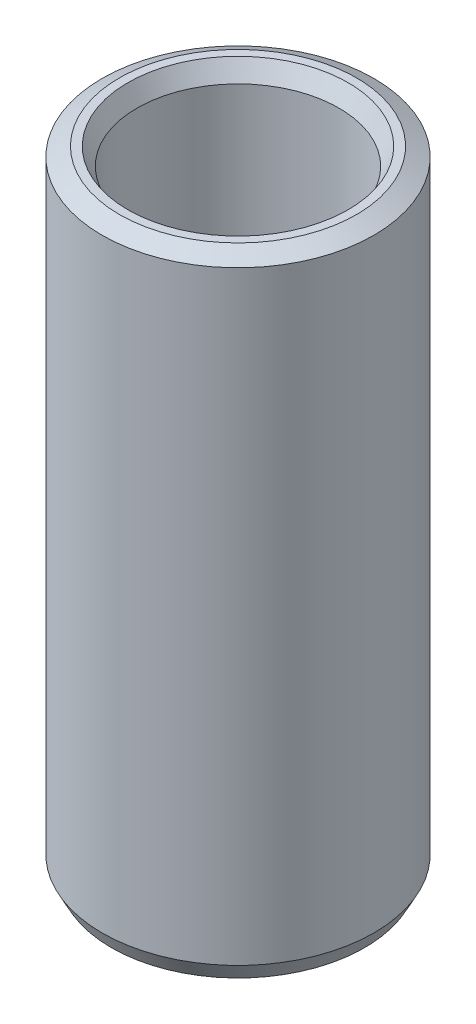
ISO-10303-21;
HEADER;
FILE_DESCRIPTION(('STEP AP214'),'2;1');
FILE_NAME('part.step','',(''),(''),'','','');
FILE_SCHEMA(('AUTOMOTIVE_DESIGN { 1 0 10303 214 1 1 1 1 }'));
ENDSEC;
DATA;
#1=APPLICATION_CONTEXT('core data for automotive mechanical design processes');
#2=APPLICATION_PROTOCOL_DEFINITION('international standard','automotive_design',2000,#1);
#3=PRODUCT_CONTEXT('',#1,'mechanical');
#4=PRODUCT('Part','Part','',(#3));
#5=PRODUCT_RELATED_PRODUCT_CATEGORY('part','',(#4));
#6=PRODUCT_DEFINITION_FORMATION('','',#4);
#7=PRODUCT_DEFINITION_CONTEXT('part definition',#1,'design');
#8=PRODUCT_DEFINITION('design','',#6,#7);
#9=PRODUCT_DEFINITION_SHAPE('','',#8);
#10=(LENGTH_UNIT() NAMED_UNIT(*) SI_UNIT(.MILLI.,.METRE.));
#11=(NAMED_UNIT(*) PLANE_ANGLE_UNIT() SI_UNIT($,.RADIAN.));
#12=(NAMED_UNIT(*) SI_UNIT($,.STERADIAN.) SOLID_ANGLE_UNIT());
#13=UNCERTAINTY_MEASURE_WITH_UNIT(LENGTH_MEASURE(1.E-05),#10,'distance_accuracy_value','');
#14=(GEOMETRIC_REPRESENTATION_CONTEXT(3) GLOBAL_UNCERTAINTY_ASSIGNED_CONTEXT((#13)) GLOBAL_UNIT_ASSIGNED_CONTEXT((#10,
#11,#12)) REPRESENTATION_CONTEXT('',''));
#15=CARTESIAN_POINT('',(0.,0.,0.));
#16=DIRECTION('',(0.,0.,1.));
#17=DIRECTION('',(1.,0.,0.));
#18=AXIS2_PLACEMENT_3D('',#15,#16,#17);
#19=CARTESIAN_POINT('',(0.,232.111634724328,0.));
#20=DIRECTION('',(0.,-1.,0.));
#21=DIRECTION('',(0.,0.,-1.));
#22=AXIS2_PLACEMENT_3D('',#19,#20,#21);
#23=CYLINDRICAL_SURFACE('',#22,50.);
#24=CARTESIAN_POINT('',(0.,6.39816600949961,0.));
#25=DIRECTION('',(0.,1.,0.));
#26=DIRECTION('',(0.,0.,1.));
#27=AXIS2_PLACEMENT_3D('',#24,#25,#26);
#28=CIRCLE('',#27,50.);
#29=CARTESIAN_POINT('',(0.,6.39816600949961,50.));
#30=VERTEX_POINT('',#29);
#31=EDGE_CURVE('E10',#30,#30,#28,.T.);
#32=ORIENTED_EDGE('',*,*,#31,.T.);
#33=EDGE_LOOP('',(#32));
#34=FACE_BOUND('',#33,.T.);
#35=CARTESIAN_POINT('',(0.,228.724791877022,0.));
#36=DIRECTION('',(0.,1.,0.));
#37=DIRECTION('',(0.,0.,1.));
#38=AXIS2_PLACEMENT_3D('',#35,#36,#37);
#39=CIRCLE('',#38,50.);
#40=CARTESIAN_POINT('',(0.,228.724791877022,50.));
#41=VERTEX_POINT('',#40);
#42=EDGE_CURVE('E50',#41,#41,#39,.F.);
#43=ORIENTED_EDGE('',*,*,#42,.T.);
#44=EDGE_LOOP('',(#43));
#45=FACE_BOUND('',#44,.T.);
#46=ADVANCED_FACE('F39',(#34,#45),#23,.T.);
#47=CARTESIAN_POINT('',(0.,232.111634724328,0.));
#48=DIRECTION('',(0.,1.,0.));
#49=DIRECTION('',(0.,0.,1.));
#50=AXIS2_PLACEMENT_3D('',#47,#48,#49);
#51=PLANE('',#50);
#52=CARTESIAN_POINT('',(0.,232.111634724328,0.));
#53=DIRECTION('',(0.,1.,0.));
#54=DIRECTION('',(0.,0.,1.));
#55=AXIS2_PLACEMENT_3D('',#52,#53,#54);
#56=CIRCLE('',#55,40.5227687958381);
#57=CARTESIAN_POINT('',(0.,232.111634724328,40.5227687958381));
#58=VERTEX_POINT('',#57);
#59=EDGE_CURVE('E58',#58,#58,#56,.F.);
#60=ORIENTED_EDGE('',*,*,#59,.T.);
#61=EDGE_LOOP('',(#60));
#62=FACE_BOUND('',#61,.T.);
#63=CARTESIAN_POINT('',(0.,232.111634724328,0.));
#64=DIRECTION('',(0.,1.,0.));
#65=DIRECTION('',(0.,0.,1.));
#66=AXIS2_PLACEMENT_3D('',#63,#64,#65);
#67=CIRCLE('',#66,43.6018339905004);
#68=CARTESIAN_POINT('',(0.,232.111634724328,43.6018339905004));
#69=VERTEX_POINT('',#68);
#70=EDGE_CURVE('E61',#69,#69,#67,.T.);
#71=ORIENTED_EDGE('',*,*,#70,.T.);
#72=EDGE_LOOP('',(#71));
#73=FACE_BOUND('',#72,.T.);
#74=ADVANCED_FACE('F88',(#62,#73),#51,.T.);
#75=CARTESIAN_POINT('',(0.,0.,0.));
#76=DIRECTION('',(0.,1.,0.));
#77=DIRECTION('',(0.,0.,1.));
#78=AXIS2_PLACEMENT_3D('',#75,#76,#77);
#79=PLANE('',#78);
#80=CARTESIAN_POINT('',(0.,0.,0.));
#81=DIRECTION('',(0.,1.,0.));
#82=DIRECTION('',(0.,0.,1.));
#83=AXIS2_PLACEMENT_3D('',#80,#81,#82);
#84=CIRCLE('',#83,43.5340919580323);
#85=CARTESIAN_POINT('',(0.,0.,43.5340919580323));
#86=VERTEX_POINT('',#85);
#87=EDGE_CURVE('E51',#86,#86,#84,.T.);
#88=ORIENTED_EDGE('',*,*,#87,.T.);
#89=EDGE_LOOP('',(#88));
#90=FACE_BOUND('',#89,.T.);
#91=CARTESIAN_POINT('',(0.,0.,0.));
#92=DIRECTION('',(0.,1.,0.));
#93=DIRECTION('',(0.,0.,1.));
#94=AXIS2_PLACEMENT_3D('',#91,#92,#93);
#95=CIRCLE('',#94,46.6131571526945);
#96=CARTESIAN_POINT('',(0.,0.,46.6131571526945));
#97=VERTEX_POINT('',#96);
#98=EDGE_CURVE('E54',#97,#97,#95,.F.);
#99=ORIENTED_EDGE('',*,*,#98,.T.);
#100=EDGE_LOOP('',(#99));
#101=FACE_BOUND('',#100,.T.);
#102=ADVANCED_FACE('F83',(#90,#101),#79,.F.);
#103=CARTESIAN_POINT('',(0.,232.111634724328,0.));
#104=DIRECTION('',(0.,-1.,0.));
#105=DIRECTION('',(0.,0.,-1.));
#106=AXIS2_PLACEMENT_3D('',#103,#104,#105);
#107=CYLINDRICAL_SURFACE('',#106,37.1359259485327);
#108=CARTESIAN_POINT('',(0.,225.713468714828,0.));
#109=DIRECTION('',(0.,1.,0.));
#110=DIRECTION('',(0.,0.,1.));
#111=AXIS2_PLACEMENT_3D('',#108,#109,#110);
#112=CIRCLE('',#111,37.1359259485327);
#113=CARTESIAN_POINT('',(0.,225.713468714828,37.1359259485327));
#114=VERTEX_POINT('',#113);
#115=EDGE_CURVE('E67',#114,#114,#112,.T.);
#116=ORIENTED_EDGE('',*,*,#115,.T.);
#117=EDGE_LOOP('',(#116));
#118=FACE_BOUND('',#117,.T.);
#119=CARTESIAN_POINT('',(0.,3.3868428473055,0.));
#120=DIRECTION('',(0.,1.,0.));
#121=DIRECTION('',(0.,0.,1.));
#122=AXIS2_PLACEMENT_3D('',#119,#120,#121);
#123=CIRCLE('',#122,37.1359259485327);
#124=CARTESIAN_POINT('',(0.,3.3868428473055,37.1359259485327));
#125=VERTEX_POINT('',#124);
#126=EDGE_CURVE('E69',#125,#125,#123,.F.);
#127=ORIENTED_EDGE('',*,*,#126,.T.);
#128=EDGE_LOOP('',(#127));
#129=FACE_BOUND('',#128,.T.);
#130=ADVANCED_FACE('F71',(#118,#129),#107,.F.);
#131=CARTESIAN_POINT('',(0.,225.713468714828,0.));
#132=DIRECTION('',(0.,1.,0.));
#133=DIRECTION('',(0.,0.,1.));
#134=AXIS2_PLACEMENT_3D('',#131,#132,#133);
#135=CONICAL_SURFACE('',#134,37.1359259485327,0.486847772850312);
#136=ORIENTED_EDGE('',*,*,#59,.F.);
#137=EDGE_LOOP('',(#136));
#138=FACE_BOUND('',#137,.T.);
#139=ORIENTED_EDGE('',*,*,#115,.F.);
#140=EDGE_LOOP('',(#139));
#141=FACE_BOUND('',#140,.T.);
#142=ADVANCED_FACE('F77',(#138,#141),#135,.F.);
#143=CARTESIAN_POINT('',(0.,0.,0.));
#144=DIRECTION('',(0.,-1.,0.));
#145=DIRECTION('',(0.,0.,-1.));
#146=AXIS2_PLACEMENT_3D('',#143,#144,#145);
#147=CONICAL_SURFACE('',#146,43.5340919580323,1.08394855394458);
#148=ORIENTED_EDGE('',*,*,#126,.F.);
#149=EDGE_LOOP('',(#148));
#150=FACE_BOUND('',#149,.T.);
#151=ORIENTED_EDGE('',*,*,#87,.F.);
#152=EDGE_LOOP('',(#151));
#153=FACE_BOUND('',#152,.T.);
#154=ADVANCED_FACE('F73',(#150,#153),#147,.F.);
#155=CARTESIAN_POINT('',(0.,6.39816600949961,0.));
#156=DIRECTION('',(0.,1.,0.));
#157=DIRECTION('',(0.,0.,1.));
#158=AXIS2_PLACEMENT_3D('',#155,#156,#157);
#159=CONICAL_SURFACE('',#158,50.,0.486847772850316);
#160=ORIENTED_EDGE('',*,*,#98,.F.);
#161=EDGE_LOOP('',(#160));
#162=FACE_BOUND('',#161,.T.);
#163=ORIENTED_EDGE('',*,*,#31,.F.);
#164=EDGE_LOOP('',(#163));
#165=FACE_BOUND('',#164,.T.);
#166=ADVANCED_FACE('F76',(#162,#165),#159,.T.);
#167=CARTESIAN_POINT('',(0.,232.111634724328,0.));
#168=DIRECTION('',(0.,-1.,0.));
#169=DIRECTION('',(0.,0.,-1.));
#170=AXIS2_PLACEMENT_3D('',#167,#168,#169);
#171=CONICAL_SURFACE('',#170,43.6018339905004,1.08394855394458);
#172=ORIENTED_EDGE('',*,*,#42,.F.);
#173=EDGE_LOOP('',(#172));
#174=FACE_BOUND('',#173,.T.);
#175=ORIENTED_EDGE('',*,*,#70,.F.);
#176=EDGE_LOOP('',(#175));
#177=FACE_BOUND('',#176,.T.);
#178=ADVANCED_FACE('F45',(#174,#177),#171,.T.);
#179=CLOSED_SHELL('',(#46,#74,#102,#130,#142,#154,#166,#178));
#180=MANIFOLD_SOLID_BREP('B2',#179);
#181=ADVANCED_BREP_SHAPE_REPRESENTATION('',(#18,#180),#14);
#182=SHAPE_DEFINITION_REPRESENTATION(#9,#181);
ENDSEC;
END-ISO-10303-21;
